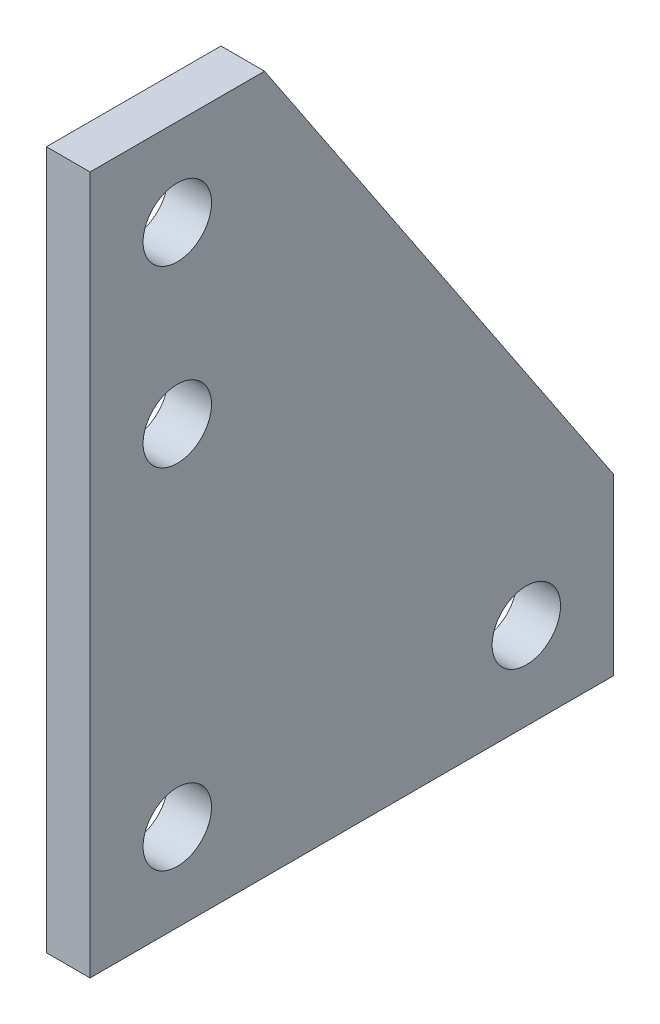
ISO-10303-21;
HEADER;
FILE_DESCRIPTION(('STEP AP214'),'2;1');
FILE_NAME('part.step','',(''),(''),'','','');
FILE_SCHEMA(('AUTOMOTIVE_DESIGN { 1 0 10303 214 1 1 1 1 }'));
ENDSEC;
DATA;
#1=APPLICATION_CONTEXT('core data for automotive mechanical design processes');
#2=APPLICATION_PROTOCOL_DEFINITION('international standard','automotive_design',2000,#1);
#3=PRODUCT_CONTEXT('',#1,'mechanical');
#4=PRODUCT('Part','Part','',(#3));
#5=PRODUCT_RELATED_PRODUCT_CATEGORY('part','',(#4));
#6=PRODUCT_DEFINITION_FORMATION('','',#4);
#7=PRODUCT_DEFINITION_CONTEXT('part definition',#1,'design');
#8=PRODUCT_DEFINITION('design','',#6,#7);
#9=PRODUCT_DEFINITION_SHAPE('','',#8);
#10=(LENGTH_UNIT() NAMED_UNIT(*) SI_UNIT(.MILLI.,.METRE.));
#11=(NAMED_UNIT(*) PLANE_ANGLE_UNIT() SI_UNIT($,.RADIAN.));
#12=(NAMED_UNIT(*) SI_UNIT($,.STERADIAN.) SOLID_ANGLE_UNIT());
#13=UNCERTAINTY_MEASURE_WITH_UNIT(LENGTH_MEASURE(1.E-05),#10,'distance_accuracy_value','');
#14=(GEOMETRIC_REPRESENTATION_CONTEXT(3) GLOBAL_UNCERTAINTY_ASSIGNED_CONTEXT((#13)) GLOBAL_UNIT_ASSIGNED_CONTEXT((#10,
#11,#12)) REPRESENTATION_CONTEXT('',''));
#15=CARTESIAN_POINT('',(0.,0.,0.));
#16=DIRECTION('',(0.,0.,1.));
#17=DIRECTION('',(1.,0.,0.));
#18=AXIS2_PLACEMENT_3D('',#15,#16,#17);
#19=CARTESIAN_POINT('',(3.175,0.,0.));
#20=DIRECTION('',(1.,0.,0.));
#21=DIRECTION('',(0.,0.,-1.));
#22=AXIS2_PLACEMENT_3D('',#19,#20,#21);
#23=PLANE('',#22);
#24=CARTESIAN_POINT('',(3.175,6.35,-6.35));
#25=DIRECTION('',(1.,0.,0.));
#26=DIRECTION('',(0.,0.,-1.));
#27=AXIS2_PLACEMENT_3D('',#24,#25,#26);
#28=CIRCLE('',#27,2.4892);
#29=CARTESIAN_POINT('',(3.175,6.35,-8.8392));
#30=VERTEX_POINT('',#29);
#31=EDGE_CURVE('E171',#30,#30,#28,.T.);
#32=ORIENTED_EDGE('',*,*,#31,.F.);
#33=EDGE_LOOP('',(#32));
#34=FACE_BOUND('',#33,.T.);
#35=CARTESIAN_POINT('',(3.175,31.75,-6.35));
#36=DIRECTION('',(1.,0.,0.));
#37=DIRECTION('',(0.,0.,-1.));
#38=AXIS2_PLACEMENT_3D('',#35,#36,#37);
#39=CIRCLE('',#38,2.4892);
#40=CARTESIAN_POINT('',(3.175,31.75,-8.83920000000001));
#41=VERTEX_POINT('',#40);
#42=EDGE_CURVE('E111',#41,#41,#39,.T.);
#43=ORIENTED_EDGE('',*,*,#42,.F.);
#44=EDGE_LOOP('',(#43));
#45=FACE_BOUND('',#44,.T.);
#46=DIRECTION('',(0.,-1.,0.));
#47=VECTOR('',#46,1.);
#48=CARTESIAN_POINT('',(3.175,50.8,0.));
#49=LINE('',#48,#47);
#50=CARTESIAN_POINT('',(3.175,50.8,0.));
#51=VERTEX_POINT('',#50);
#52=CARTESIAN_POINT('',(3.175,0.,0.));
#53=VERTEX_POINT('',#52);
#54=EDGE_CURVE('E116',#51,#53,#49,.T.);
#55=ORIENTED_EDGE('',*,*,#54,.T.);
#56=DIRECTION('',(0.,0.,-1.));
#57=VECTOR('',#56,1.);
#58=CARTESIAN_POINT('',(3.175,0.,0.));
#59=LINE('',#58,#57);
#60=CARTESIAN_POINT('',(3.175,0.,-38.1));
#61=VERTEX_POINT('',#60);
#62=EDGE_CURVE('E83',#53,#61,#59,.T.);
#63=ORIENTED_EDGE('',*,*,#62,.T.);
#64=DIRECTION('',(0.,1.,0.));
#65=VECTOR('',#64,1.);
#66=CARTESIAN_POINT('',(3.175,0.,-38.1));
#67=LINE('',#66,#65);
#68=CARTESIAN_POINT('',(3.175,12.7,-38.1));
#69=VERTEX_POINT('',#68);
#70=EDGE_CURVE('E87',#61,#69,#67,.T.);
#71=ORIENTED_EDGE('',*,*,#70,.T.);
#72=DIRECTION('',(0.,0.832050294337844,0.554700196225229));
#73=VECTOR('',#72,1.);
#74=CARTESIAN_POINT('',(3.175,50.8,-12.7));
#75=LINE('',#74,#73);
#76=CARTESIAN_POINT('',(3.175,50.8,-12.7));
#77=VERTEX_POINT('',#76);
#78=EDGE_CURVE('E91',#69,#77,#75,.T.);
#79=ORIENTED_EDGE('',*,*,#78,.T.);
#80=DIRECTION('',(0.,0.,1.));
#81=VECTOR('',#80,1.);
#82=CARTESIAN_POINT('',(3.175,50.8,0.));
#83=LINE('',#82,#81);
#84=EDGE_CURVE('E49',#77,#51,#83,.T.);
#85=ORIENTED_EDGE('',*,*,#84,.T.);
#86=EDGE_LOOP('',(#55,#63,#71,#79,#85));
#87=FACE_BOUND('',#86,.T.);
#88=CARTESIAN_POINT('',(3.175,44.45,-6.35));
#89=DIRECTION('',(1.,0.,0.));
#90=DIRECTION('',(0.,0.,-1.));
#91=AXIS2_PLACEMENT_3D('',#88,#89,#90);
#92=CIRCLE('',#91,2.4892);
#93=CARTESIAN_POINT('',(3.175,44.45,-8.83920000000001));
#94=VERTEX_POINT('',#93);
#95=EDGE_CURVE('E177',#94,#94,#92,.T.);
#96=ORIENTED_EDGE('',*,*,#95,.F.);
#97=EDGE_LOOP('',(#96));
#98=FACE_BOUND('',#97,.T.);
#99=CARTESIAN_POINT('',(3.175,6.35,-31.75));
#100=DIRECTION('',(1.,0.,0.));
#101=DIRECTION('',(0.,0.,-1.));
#102=AXIS2_PLACEMENT_3D('',#99,#100,#101);
#103=CIRCLE('',#102,2.4892);
#104=CARTESIAN_POINT('',(3.175,6.35,-34.2392));
#105=VERTEX_POINT('',#104);
#106=EDGE_CURVE('E162',#105,#105,#103,.T.);
#107=ORIENTED_EDGE('',*,*,#106,.F.);
#108=EDGE_LOOP('',(#107));
#109=FACE_BOUND('',#108,.T.);
#110=ADVANCED_FACE('F32',(#34,#45,#87,#98,#109),#23,.T.);
#111=CARTESIAN_POINT('',(0.,0.,0.));
#112=DIRECTION('',(1.,0.,0.));
#113=DIRECTION('',(0.,0.,-1.));
#114=AXIS2_PLACEMENT_3D('',#111,#112,#113);
#115=PLANE('',#114);
#116=DIRECTION('',(0.,-1.,0.));
#117=VECTOR('',#116,1.);
#118=CARTESIAN_POINT('',(0.,50.8,0.));
#119=LINE('',#118,#117);
#120=CARTESIAN_POINT('',(0.,50.8,0.));
#121=VERTEX_POINT('',#120);
#122=CARTESIAN_POINT('',(0.,0.,0.));
#123=VERTEX_POINT('',#122);
#124=EDGE_CURVE('E107',#121,#123,#119,.T.);
#125=ORIENTED_EDGE('',*,*,#124,.F.);
#126=DIRECTION('',(0.,0.,1.));
#127=VECTOR('',#126,1.);
#128=CARTESIAN_POINT('',(0.,50.8,0.));
#129=LINE('',#128,#127);
#130=CARTESIAN_POINT('',(0.,50.8,-12.7));
#131=VERTEX_POINT('',#130);
#132=EDGE_CURVE('E75',#131,#121,#129,.T.);
#133=ORIENTED_EDGE('',*,*,#132,.F.);
#134=DIRECTION('',(0.,0.832050294337844,0.554700196225229));
#135=VECTOR('',#134,1.);
#136=CARTESIAN_POINT('',(0.,50.8,-12.7));
#137=LINE('',#136,#135);
#138=CARTESIAN_POINT('',(0.,12.7,-38.1));
#139=VERTEX_POINT('',#138);
#140=EDGE_CURVE('E69',#139,#131,#137,.T.);
#141=ORIENTED_EDGE('',*,*,#140,.F.);
#142=DIRECTION('',(0.,1.,0.));
#143=VECTOR('',#142,1.);
#144=CARTESIAN_POINT('',(0.,0.,-38.1));
#145=LINE('',#144,#143);
#146=CARTESIAN_POINT('',(0.,0.,-38.1));
#147=VERTEX_POINT('',#146);
#148=EDGE_CURVE('E98',#147,#139,#145,.T.);
#149=ORIENTED_EDGE('',*,*,#148,.F.);
#150=DIRECTION('',(0.,0.,-1.));
#151=VECTOR('',#150,1.);
#152=CARTESIAN_POINT('',(0.,0.,0.));
#153=LINE('',#152,#151);
#154=EDGE_CURVE('E110',#123,#147,#153,.T.);
#155=ORIENTED_EDGE('',*,*,#154,.F.);
#156=EDGE_LOOP('',(#125,#133,#141,#149,#155));
#157=FACE_BOUND('',#156,.T.);
#158=CARTESIAN_POINT('',(0.,31.75,-6.35));
#159=DIRECTION('',(1.,0.,0.));
#160=DIRECTION('',(0.,0.,-1.));
#161=AXIS2_PLACEMENT_3D('',#158,#159,#160);
#162=CIRCLE('',#161,2.4892);
#163=CARTESIAN_POINT('',(0.,31.75,-8.83920000000001));
#164=VERTEX_POINT('',#163);
#165=EDGE_CURVE('E180',#164,#164,#162,.T.);
#166=ORIENTED_EDGE('',*,*,#165,.T.);
#167=EDGE_LOOP('',(#166));
#168=FACE_BOUND('',#167,.T.);
#169=CARTESIAN_POINT('',(0.,44.45,-6.35));
#170=DIRECTION('',(1.,0.,0.));
#171=DIRECTION('',(0.,0.,-1.));
#172=AXIS2_PLACEMENT_3D('',#169,#170,#171);
#173=CIRCLE('',#172,2.4892);
#174=CARTESIAN_POINT('',(0.,44.45,-8.83920000000001));
#175=VERTEX_POINT('',#174);
#176=EDGE_CURVE('E174',#175,#175,#173,.T.);
#177=ORIENTED_EDGE('',*,*,#176,.T.);
#178=EDGE_LOOP('',(#177));
#179=FACE_BOUND('',#178,.T.);
#180=CARTESIAN_POINT('',(0.,6.35,-6.35));
#181=DIRECTION('',(1.,0.,0.));
#182=DIRECTION('',(0.,0.,-1.));
#183=AXIS2_PLACEMENT_3D('',#180,#181,#182);
#184=CIRCLE('',#183,2.4892);
#185=CARTESIAN_POINT('',(0.,6.35,-8.8392));
#186=VERTEX_POINT('',#185);
#187=EDGE_CURVE('E168',#186,#186,#184,.T.);
#188=ORIENTED_EDGE('',*,*,#187,.T.);
#189=EDGE_LOOP('',(#188));
#190=FACE_BOUND('',#189,.T.);
#191=CARTESIAN_POINT('',(0.,6.35,-31.75));
#192=DIRECTION('',(1.,0.,0.));
#193=DIRECTION('',(0.,0.,-1.));
#194=AXIS2_PLACEMENT_3D('',#191,#192,#193);
#195=CIRCLE('',#194,2.4892);
#196=CARTESIAN_POINT('',(0.,6.35,-34.2392));
#197=VERTEX_POINT('',#196);
#198=EDGE_CURVE('E165',#197,#197,#195,.T.);
#199=ORIENTED_EDGE('',*,*,#198,.T.);
#200=EDGE_LOOP('',(#199));
#201=FACE_BOUND('',#200,.T.);
#202=ADVANCED_FACE('F120',(#157,#168,#179,#190,#201),#115,.F.);
#203=CARTESIAN_POINT('',(3.175,50.8,0.));
#204=DIRECTION('',(0.,0.,-1.));
#205=DIRECTION('',(0.,1.,0.));
#206=AXIS2_PLACEMENT_3D('',#203,#204,#205);
#207=PLANE('',#206);
#208=ORIENTED_EDGE('',*,*,#124,.T.);
#209=DIRECTION('',(-1.,0.,0.));
#210=VECTOR('',#209,1.);
#211=CARTESIAN_POINT('',(3.175,0.,0.));
#212=LINE('',#211,#210);
#213=EDGE_CURVE('E11',#53,#123,#212,.T.);
#214=ORIENTED_EDGE('',*,*,#213,.F.);
#215=ORIENTED_EDGE('',*,*,#54,.F.);
#216=DIRECTION('',(-1.,0.,0.));
#217=VECTOR('',#216,1.);
#218=CARTESIAN_POINT('',(3.175,50.8,0.));
#219=LINE('',#218,#217);
#220=EDGE_CURVE('E103',#51,#121,#219,.T.);
#221=ORIENTED_EDGE('',*,*,#220,.T.);
#222=EDGE_LOOP('',(#208,#214,#215,#221));
#223=FACE_BOUND('',#222,.T.);
#224=ADVANCED_FACE('F34',(#223),#207,.F.);
#225=CARTESIAN_POINT('',(3.175,0.,0.));
#226=DIRECTION('',(0.,1.,0.));
#227=DIRECTION('',(0.,0.,1.));
#228=AXIS2_PLACEMENT_3D('',#225,#226,#227);
#229=PLANE('',#228);
#230=ORIENTED_EDGE('',*,*,#154,.T.);
#231=DIRECTION('',(-1.,0.,0.));
#232=VECTOR('',#231,1.);
#233=CARTESIAN_POINT('',(3.175,0.,-38.1));
#234=LINE('',#233,#232);
#235=EDGE_CURVE('E41',#61,#147,#234,.T.);
#236=ORIENTED_EDGE('',*,*,#235,.F.);
#237=ORIENTED_EDGE('',*,*,#62,.F.);
#238=ORIENTED_EDGE('',*,*,#213,.T.);
#239=EDGE_LOOP('',(#230,#236,#237,#238));
#240=FACE_BOUND('',#239,.T.);
#241=ADVANCED_FACE('F229',(#240),#229,.F.);
#242=CARTESIAN_POINT('',(3.175,0.,-38.1));
#243=DIRECTION('',(0.,0.,1.));
#244=DIRECTION('',(0.,-1.,0.));
#245=AXIS2_PLACEMENT_3D('',#242,#243,#244);
#246=PLANE('',#245);
#247=ORIENTED_EDGE('',*,*,#148,.T.);
#248=DIRECTION('',(-1.,0.,0.));
#249=VECTOR('',#248,1.);
#250=CARTESIAN_POINT('',(3.175,12.7,-38.1));
#251=LINE('',#250,#249);
#252=EDGE_CURVE('E95',#69,#139,#251,.T.);
#253=ORIENTED_EDGE('',*,*,#252,.F.);
#254=ORIENTED_EDGE('',*,*,#70,.F.);
#255=ORIENTED_EDGE('',*,*,#235,.T.);
#256=EDGE_LOOP('',(#247,#253,#254,#255));
#257=FACE_BOUND('',#256,.T.);
#258=ADVANCED_FACE('F96',(#257),#246,.F.);
#259=CARTESIAN_POINT('',(3.175,50.8,-12.7));
#260=DIRECTION('',(0.,-0.554700196225229,0.832050294337844));
#261=DIRECTION('',(0.,-0.832050294337844,-0.554700196225229));
#262=AXIS2_PLACEMENT_3D('',#259,#260,#261);
#263=PLANE('',#262);
#264=ORIENTED_EDGE('',*,*,#140,.T.);
#265=DIRECTION('',(-1.,0.,0.));
#266=VECTOR('',#265,1.);
#267=CARTESIAN_POINT('',(3.175,50.8,-12.7));
#268=LINE('',#267,#266);
#269=EDGE_CURVE('E99',#77,#131,#268,.T.);
#270=ORIENTED_EDGE('',*,*,#269,.F.);
#271=ORIENTED_EDGE('',*,*,#78,.F.);
#272=ORIENTED_EDGE('',*,*,#252,.T.);
#273=EDGE_LOOP('',(#264,#270,#271,#272));
#274=FACE_BOUND('',#273,.T.);
#275=ADVANCED_FACE('F101',(#274),#263,.F.);
#276=CARTESIAN_POINT('',(3.175,50.8,0.));
#277=DIRECTION('',(0.,-1.,0.));
#278=DIRECTION('',(0.,0.,-1.));
#279=AXIS2_PLACEMENT_3D('',#276,#277,#278);
#280=PLANE('',#279);
#281=ORIENTED_EDGE('',*,*,#132,.T.);
#282=ORIENTED_EDGE('',*,*,#220,.F.);
#283=ORIENTED_EDGE('',*,*,#84,.F.);
#284=ORIENTED_EDGE('',*,*,#269,.T.);
#285=EDGE_LOOP('',(#281,#282,#283,#284));
#286=FACE_BOUND('',#285,.T.);
#287=ADVANCED_FACE('F125',(#286),#280,.F.);
#288=CARTESIAN_POINT('',(3.175,31.75,-6.35));
#289=DIRECTION('',(-1.,0.,0.));
#290=DIRECTION('',(0.,0.,1.));
#291=AXIS2_PLACEMENT_3D('',#288,#289,#290);
#292=CYLINDRICAL_SURFACE('',#291,2.4892);
#293=ORIENTED_EDGE('',*,*,#42,.T.);
#294=EDGE_LOOP('',(#293));
#295=FACE_BOUND('',#294,.T.);
#296=ORIENTED_EDGE('',*,*,#165,.F.);
#297=EDGE_LOOP('',(#296));
#298=FACE_BOUND('',#297,.T.);
#299=ADVANCED_FACE('F127',(#295,#298),#292,.F.);
#300=CARTESIAN_POINT('',(3.175,44.45,-6.35));
#301=DIRECTION('',(-1.,0.,0.));
#302=DIRECTION('',(0.,0.,1.));
#303=AXIS2_PLACEMENT_3D('',#300,#301,#302);
#304=CYLINDRICAL_SURFACE('',#303,2.4892);
#305=ORIENTED_EDGE('',*,*,#95,.T.);
#306=EDGE_LOOP('',(#305));
#307=FACE_BOUND('',#306,.T.);
#308=ORIENTED_EDGE('',*,*,#176,.F.);
#309=EDGE_LOOP('',(#308));
#310=FACE_BOUND('',#309,.T.);
#311=ADVANCED_FACE('F133',(#307,#310),#304,.F.);
#312=CARTESIAN_POINT('',(3.175,6.35,-6.35));
#313=DIRECTION('',(-1.,0.,0.));
#314=DIRECTION('',(0.,0.,1.));
#315=AXIS2_PLACEMENT_3D('',#312,#313,#314);
#316=CYLINDRICAL_SURFACE('',#315,2.4892);
#317=ORIENTED_EDGE('',*,*,#31,.T.);
#318=EDGE_LOOP('',(#317));
#319=FACE_BOUND('',#318,.T.);
#320=ORIENTED_EDGE('',*,*,#187,.F.);
#321=EDGE_LOOP('',(#320));
#322=FACE_BOUND('',#321,.T.);
#323=ADVANCED_FACE('F149',(#319,#322),#316,.F.);
#324=CARTESIAN_POINT('',(3.175,6.35,-31.75));
#325=DIRECTION('',(-1.,0.,0.));
#326=DIRECTION('',(0.,0.,1.));
#327=AXIS2_PLACEMENT_3D('',#324,#325,#326);
#328=CYLINDRICAL_SURFACE('',#327,2.4892);
#329=ORIENTED_EDGE('',*,*,#106,.T.);
#330=EDGE_LOOP('',(#329));
#331=FACE_BOUND('',#330,.T.);
#332=ORIENTED_EDGE('',*,*,#198,.F.);
#333=EDGE_LOOP('',(#332));
#334=FACE_BOUND('',#333,.T.);
#335=ADVANCED_FACE('F153',(#331,#334),#328,.F.);
#336=CLOSED_SHELL('',(#110,#202,#224,#241,#258,#275,#287,#299,#311,#323,#335));
#337=MANIFOLD_SOLID_BREP('B2',#336);
#338=ADVANCED_BREP_SHAPE_REPRESENTATION('',(#18,#337),#14);
#339=SHAPE_DEFINITION_REPRESENTATION(#9,#338);
ENDSEC;
END-ISO-10303-21;
